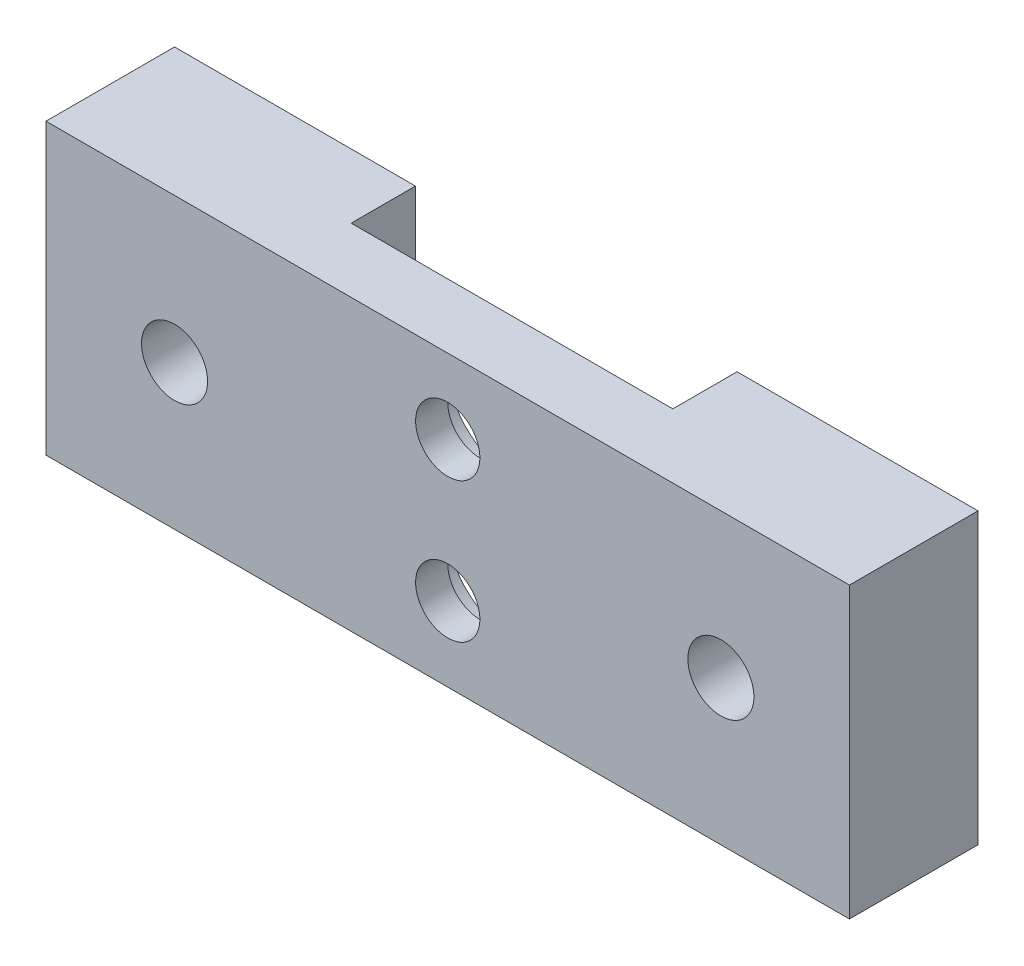
ISO-10303-21;
HEADER;
FILE_DESCRIPTION(('STEP AP214'),'2;1');
FILE_NAME('part.step','',(''),(''),'','','');
FILE_SCHEMA(('AUTOMOTIVE_DESIGN { 1 0 10303 214 1 1 1 1 }'));
ENDSEC;
DATA;
#1=APPLICATION_CONTEXT('core data for automotive mechanical design processes');
#2=APPLICATION_PROTOCOL_DEFINITION('international standard','automotive_design',2000,#1);
#3=PRODUCT_CONTEXT('',#1,'mechanical');
#4=PRODUCT('Part','Part','',(#3));
#5=PRODUCT_RELATED_PRODUCT_CATEGORY('part','',(#4));
#6=PRODUCT_DEFINITION_FORMATION('','',#4);
#7=PRODUCT_DEFINITION_CONTEXT('part definition',#1,'design');
#8=PRODUCT_DEFINITION('design','',#6,#7);
#9=PRODUCT_DEFINITION_SHAPE('','',#8);
#10=(LENGTH_UNIT() NAMED_UNIT(*) SI_UNIT(.MILLI.,.METRE.));
#11=(NAMED_UNIT(*) PLANE_ANGLE_UNIT() SI_UNIT($,.RADIAN.));
#12=(NAMED_UNIT(*) SI_UNIT($,.STERADIAN.) SOLID_ANGLE_UNIT());
#13=UNCERTAINTY_MEASURE_WITH_UNIT(LENGTH_MEASURE(1.E-05),#10,'distance_accuracy_value','');
#14=(GEOMETRIC_REPRESENTATION_CONTEXT(3) GLOBAL_UNCERTAINTY_ASSIGNED_CONTEXT((#13)) GLOBAL_UNIT_ASSIGNED_CONTEXT((#10,
#11,#12)) REPRESENTATION_CONTEXT('',''));
#15=CARTESIAN_POINT('',(0.,0.,0.));
#16=DIRECTION('',(0.,0.,1.));
#17=DIRECTION('',(1.,0.,0.));
#18=AXIS2_PLACEMENT_3D('',#15,#16,#17);
#19=CARTESIAN_POINT('',(-39.6875,28.575,-12.7));
#20=DIRECTION('',(1.,0.,0.));
#21=DIRECTION('',(0.,0.,-1.));
#22=AXIS2_PLACEMENT_3D('',#19,#20,#21);
#23=PLANE('',#22);
#24=DIRECTION('',(0.,0.,1.));
#25=VECTOR('',#24,1.);
#26=CARTESIAN_POINT('',(-39.6875,0.,-12.7));
#27=LINE('',#26,#25);
#28=CARTESIAN_POINT('',(-39.6875,0.,-12.7));
#29=VERTEX_POINT('',#28);
#30=CARTESIAN_POINT('',(-39.6875,0.,0.));
#31=VERTEX_POINT('',#30);
#32=EDGE_CURVE('E131',#29,#31,#27,.T.);
#33=ORIENTED_EDGE('',*,*,#32,.T.);
#34=DIRECTION('',(0.,-1.,0.));
#35=VECTOR('',#34,1.);
#36=CARTESIAN_POINT('',(-39.6875,28.575,0.));
#37=LINE('',#36,#35);
#38=CARTESIAN_POINT('',(-39.6875,28.575,0.));
#39=VERTEX_POINT('',#38);
#40=EDGE_CURVE('E11',#39,#31,#37,.T.);
#41=ORIENTED_EDGE('',*,*,#40,.F.);
#42=DIRECTION('',(0.,0.,1.));
#43=VECTOR('',#42,1.);
#44=CARTESIAN_POINT('',(-39.6875,28.575,-12.7));
#45=LINE('',#44,#43);
#46=CARTESIAN_POINT('',(-39.6875,28.575,-12.7));
#47=VERTEX_POINT('',#46);
#48=EDGE_CURVE('E146',#47,#39,#45,.T.);
#49=ORIENTED_EDGE('',*,*,#48,.F.);
#50=DIRECTION('',(0.,-1.,0.));
#51=VECTOR('',#50,1.);
#52=CARTESIAN_POINT('',(-39.6875,28.575,-12.7));
#53=LINE('',#52,#51);
#54=EDGE_CURVE('E127',#47,#29,#53,.T.);
#55=ORIENTED_EDGE('',*,*,#54,.T.);
#56=EDGE_LOOP('',(#33,#41,#49,#55));
#57=FACE_BOUND('',#56,.T.);
#58=ADVANCED_FACE('F35',(#57),#23,.F.);
#59=CARTESIAN_POINT('',(-39.6875,28.575,0.));
#60=DIRECTION('',(0.,0.,-1.));
#61=DIRECTION('',(-1.,0.,0.));
#62=AXIS2_PLACEMENT_3D('',#59,#60,#61);
#63=PLANE('',#62);
#64=CARTESIAN_POINT('',(0.,21.1963,0.));
#65=DIRECTION('',(0.,0.,-1.));
#66=DIRECTION('',(-1.,0.,0.));
#67=AXIS2_PLACEMENT_3D('',#64,#65,#66);
#68=CIRCLE('',#67,3.175);
#69=CARTESIAN_POINT('',(-3.175,21.1963,0.));
#70=VERTEX_POINT('',#69);
#71=EDGE_CURVE('E202',#70,#70,#68,.T.);
#72=ORIENTED_EDGE('',*,*,#71,.T.);
#73=EDGE_LOOP('',(#72));
#74=FACE_BOUND('',#73,.T.);
#75=CARTESIAN_POINT('',(0.,7.3787,0.));
#76=DIRECTION('',(0.,0.,-1.));
#77=DIRECTION('',(-1.,0.,0.));
#78=AXIS2_PLACEMENT_3D('',#75,#76,#77);
#79=CIRCLE('',#78,3.175);
#80=CARTESIAN_POINT('',(-3.175,7.3787,0.));
#81=VERTEX_POINT('',#80);
#82=EDGE_CURVE('E190',#81,#81,#79,.T.);
#83=ORIENTED_EDGE('',*,*,#82,.T.);
#84=EDGE_LOOP('',(#83));
#85=FACE_BOUND('',#84,.T.);
#86=CARTESIAN_POINT('',(-26.9875,14.2875,0.));
#87=DIRECTION('',(0.,0.,-1.));
#88=DIRECTION('',(-1.,0.,0.));
#89=AXIS2_PLACEMENT_3D('',#86,#87,#88);
#90=CIRCLE('',#89,3.2639);
#91=CARTESIAN_POINT('',(-30.2514,14.2875,0.));
#92=VERTEX_POINT('',#91);
#93=EDGE_CURVE('E184',#92,#92,#90,.T.);
#94=ORIENTED_EDGE('',*,*,#93,.T.);
#95=EDGE_LOOP('',(#94));
#96=FACE_BOUND('',#95,.T.);
#97=CARTESIAN_POINT('',(26.9875,14.2875,0.));
#98=DIRECTION('',(0.,0.,-1.));
#99=DIRECTION('',(-1.,0.,0.));
#100=AXIS2_PLACEMENT_3D('',#97,#98,#99);
#101=CIRCLE('',#100,3.2639);
#102=CARTESIAN_POINT('',(23.7236,14.2875,0.));
#103=VERTEX_POINT('',#102);
#104=EDGE_CURVE('E135',#103,#103,#101,.T.);
#105=ORIENTED_EDGE('',*,*,#104,.T.);
#106=EDGE_LOOP('',(#105));
#107=FACE_BOUND('',#106,.T.);
#108=DIRECTION('',(1.,0.,0.));
#109=VECTOR('',#108,1.);
#110=CARTESIAN_POINT('',(-39.6875,0.,0.));
#111=LINE('',#110,#109);
#112=CARTESIAN_POINT('',(39.6875,0.,0.));
#113=VERTEX_POINT('',#112);
#114=EDGE_CURVE('E134',#31,#113,#111,.T.);
#115=ORIENTED_EDGE('',*,*,#114,.T.);
#116=DIRECTION('',(0.,-1.,0.));
#117=VECTOR('',#116,1.);
#118=CARTESIAN_POINT('',(39.6875,28.575,0.));
#119=LINE('',#118,#117);
#120=CARTESIAN_POINT('',(39.6875,28.575,0.));
#121=VERTEX_POINT('',#120);
#122=EDGE_CURVE('E43',#121,#113,#119,.T.);
#123=ORIENTED_EDGE('',*,*,#122,.F.);
#124=DIRECTION('',(1.,0.,0.));
#125=VECTOR('',#124,1.);
#126=CARTESIAN_POINT('',(-39.6875,28.575,0.));
#127=LINE('',#126,#125);
#128=EDGE_CURVE('E94',#39,#121,#127,.T.);
#129=ORIENTED_EDGE('',*,*,#128,.F.);
#130=ORIENTED_EDGE('',*,*,#40,.T.);
#131=EDGE_LOOP('',(#115,#123,#129,#130));
#132=FACE_BOUND('',#131,.T.);
#133=ADVANCED_FACE('F240',(#74,#85,#96,#107,#132),#63,.F.);
#134=CARTESIAN_POINT('',(39.6875,28.575,0.));
#135=DIRECTION('',(-1.,0.,0.));
#136=DIRECTION('',(0.,0.,1.));
#137=AXIS2_PLACEMENT_3D('',#134,#135,#136);
#138=PLANE('',#137);
#139=DIRECTION('',(0.,0.,-1.));
#140=VECTOR('',#139,1.);
#141=CARTESIAN_POINT('',(39.6875,0.,0.));
#142=LINE('',#141,#140);
#143=CARTESIAN_POINT('',(39.6875,0.,-12.7));
#144=VERTEX_POINT('',#143);
#145=EDGE_CURVE('E137',#113,#144,#142,.T.);
#146=ORIENTED_EDGE('',*,*,#145,.T.);
#147=DIRECTION('',(0.,-1.,0.));
#148=VECTOR('',#147,1.);
#149=CARTESIAN_POINT('',(39.6875,28.575,-12.7));
#150=LINE('',#149,#148);
#151=CARTESIAN_POINT('',(39.6875,28.575,-12.7));
#152=VERTEX_POINT('',#151);
#153=EDGE_CURVE('E153',#152,#144,#150,.T.);
#154=ORIENTED_EDGE('',*,*,#153,.F.);
#155=DIRECTION('',(0.,0.,-1.));
#156=VECTOR('',#155,1.);
#157=CARTESIAN_POINT('',(39.6875,28.575,0.));
#158=LINE('',#157,#156);
#159=EDGE_CURVE('E161',#121,#152,#158,.T.);
#160=ORIENTED_EDGE('',*,*,#159,.F.);
#161=ORIENTED_EDGE('',*,*,#122,.T.);
#162=EDGE_LOOP('',(#146,#154,#160,#161));
#163=FACE_BOUND('',#162,.T.);
#164=ADVANCED_FACE('F159',(#163),#138,.F.);
#165=CARTESIAN_POINT('',(39.6875,28.575,-12.7));
#166=DIRECTION('',(0.,0.,1.));
#167=DIRECTION('',(1.,0.,0.));
#168=AXIS2_PLACEMENT_3D('',#165,#166,#167);
#169=PLANE('',#168);
#170=CARTESIAN_POINT('',(26.9875,14.2875,-12.7));
#171=DIRECTION('',(0.,0.,-1.));
#172=DIRECTION('',(-1.,0.,0.));
#173=AXIS2_PLACEMENT_3D('',#170,#171,#172);
#174=CIRCLE('',#173,3.2639);
#175=CARTESIAN_POINT('',(23.7236,14.2875,-12.7));
#176=VERTEX_POINT('',#175);
#177=EDGE_CURVE('E181',#176,#176,#174,.T.);
#178=ORIENTED_EDGE('',*,*,#177,.F.);
#179=EDGE_LOOP('',(#178));
#180=FACE_BOUND('',#179,.T.);
#181=DIRECTION('',(-1.,0.,0.));
#182=VECTOR('',#181,1.);
#183=CARTESIAN_POINT('',(39.6875,0.,-12.7));
#184=LINE('',#183,#182);
#185=CARTESIAN_POINT('',(15.8877,0.,-12.7));
#186=VERTEX_POINT('',#185);
#187=EDGE_CURVE('E139',#144,#186,#184,.T.);
#188=ORIENTED_EDGE('',*,*,#187,.T.);
#189=DIRECTION('',(0.,-1.,0.));
#190=VECTOR('',#189,1.);
#191=CARTESIAN_POINT('',(15.8877,28.575,-12.7));
#192=LINE('',#191,#190);
#193=CARTESIAN_POINT('',(15.8877,28.575,-12.7));
#194=VERTEX_POINT('',#193);
#195=EDGE_CURVE('E150',#194,#186,#192,.T.);
#196=ORIENTED_EDGE('',*,*,#195,.F.);
#197=DIRECTION('',(-1.,0.,0.));
#198=VECTOR('',#197,1.);
#199=CARTESIAN_POINT('',(39.6875,28.575,-12.7));
#200=LINE('',#199,#198);
#201=EDGE_CURVE('E173',#152,#194,#200,.T.);
#202=ORIENTED_EDGE('',*,*,#201,.F.);
#203=ORIENTED_EDGE('',*,*,#153,.T.);
#204=EDGE_LOOP('',(#188,#196,#202,#203));
#205=FACE_BOUND('',#204,.T.);
#206=ADVANCED_FACE('F169',(#180,#205),#169,.F.);
#207=CARTESIAN_POINT('',(15.8877,28.575,-12.7));
#208=DIRECTION('',(1.,0.,0.));
#209=DIRECTION('',(0.,0.,-1.));
#210=AXIS2_PLACEMENT_3D('',#207,#208,#209);
#211=PLANE('',#210);
#212=DIRECTION('',(0.,0.,1.));
#213=VECTOR('',#212,1.);
#214=CARTESIAN_POINT('',(15.8877,0.,-12.7));
#215=LINE('',#214,#213);
#216=CARTESIAN_POINT('',(15.8877,0.,-6.35));
#217=VERTEX_POINT('',#216);
#218=EDGE_CURVE('E141',#186,#217,#215,.T.);
#219=ORIENTED_EDGE('',*,*,#218,.T.);
#220=DIRECTION('',(0.,-1.,0.));
#221=VECTOR('',#220,1.);
#222=CARTESIAN_POINT('',(15.8877,28.575,-6.35));
#223=LINE('',#222,#221);
#224=CARTESIAN_POINT('',(15.8877,28.575,-6.35));
#225=VERTEX_POINT('',#224);
#226=EDGE_CURVE('E122',#225,#217,#223,.T.);
#227=ORIENTED_EDGE('',*,*,#226,.F.);
#228=DIRECTION('',(0.,0.,1.));
#229=VECTOR('',#228,1.);
#230=CARTESIAN_POINT('',(15.8877,28.575,-12.7));
#231=LINE('',#230,#229);
#232=EDGE_CURVE('E113',#194,#225,#231,.T.);
#233=ORIENTED_EDGE('',*,*,#232,.F.);
#234=ORIENTED_EDGE('',*,*,#195,.T.);
#235=EDGE_LOOP('',(#219,#227,#233,#234));
#236=FACE_BOUND('',#235,.T.);
#237=ADVANCED_FACE('F172',(#236),#211,.F.);
#238=CARTESIAN_POINT('',(15.8877,28.575,-6.35));
#239=DIRECTION('',(0.,0.,1.));
#240=DIRECTION('',(1.,0.,0.));
#241=AXIS2_PLACEMENT_3D('',#238,#239,#240);
#242=PLANE('',#241);
#243=CARTESIAN_POINT('',(0.,21.1963,-6.35));
#244=DIRECTION('',(0.,0.,-1.));
#245=DIRECTION('',(-1.,0.,0.));
#246=AXIS2_PLACEMENT_3D('',#243,#244,#245);
#247=CIRCLE('',#246,6.35);
#248=CARTESIAN_POINT('',(-6.35,21.1963,-6.35));
#249=VERTEX_POINT('',#248);
#250=EDGE_CURVE('E211',#249,#249,#247,.T.);
#251=ORIENTED_EDGE('',*,*,#250,.F.);
#252=EDGE_LOOP('',(#251));
#253=FACE_BOUND('',#252,.T.);
#254=CARTESIAN_POINT('',(0.,7.3787,-6.35));
#255=DIRECTION('',(0.,0.,-1.));
#256=DIRECTION('',(-1.,0.,0.));
#257=AXIS2_PLACEMENT_3D('',#254,#255,#256);
#258=CIRCLE('',#257,6.35);
#259=CARTESIAN_POINT('',(-6.35,7.3787,-6.35));
#260=VERTEX_POINT('',#259);
#261=EDGE_CURVE('E199',#260,#260,#258,.T.);
#262=ORIENTED_EDGE('',*,*,#261,.F.);
#263=EDGE_LOOP('',(#262));
#264=FACE_BOUND('',#263,.T.);
#265=DIRECTION('',(-1.,0.,0.));
#266=VECTOR('',#265,1.);
#267=CARTESIAN_POINT('',(15.8877,0.,-6.35));
#268=LINE('',#267,#266);
#269=CARTESIAN_POINT('',(-15.8877,0.,-6.35));
#270=VERTEX_POINT('',#269);
#271=EDGE_CURVE('E121',#217,#270,#268,.T.);
#272=ORIENTED_EDGE('',*,*,#271,.T.);
#273=DIRECTION('',(0.,-1.,0.));
#274=VECTOR('',#273,1.);
#275=CARTESIAN_POINT('',(-15.8877,28.575,-6.35));
#276=LINE('',#275,#274);
#277=CARTESIAN_POINT('',(-15.8877,28.575,-6.35));
#278=VERTEX_POINT('',#277);
#279=EDGE_CURVE('E118',#278,#270,#276,.T.);
#280=ORIENTED_EDGE('',*,*,#279,.F.);
#281=DIRECTION('',(-1.,0.,0.));
#282=VECTOR('',#281,1.);
#283=CARTESIAN_POINT('',(15.8877,28.575,-6.35));
#284=LINE('',#283,#282);
#285=EDGE_CURVE('E107',#225,#278,#284,.T.);
#286=ORIENTED_EDGE('',*,*,#285,.F.);
#287=ORIENTED_EDGE('',*,*,#226,.T.);
#288=EDGE_LOOP('',(#272,#280,#286,#287));
#289=FACE_BOUND('',#288,.T.);
#290=ADVANCED_FACE('F119',(#253,#264,#289),#242,.F.);
#291=CARTESIAN_POINT('',(-15.8877,28.575,-6.35));
#292=DIRECTION('',(-1.,0.,0.));
#293=DIRECTION('',(0.,0.,1.));
#294=AXIS2_PLACEMENT_3D('',#291,#292,#293);
#295=PLANE('',#294);
#296=DIRECTION('',(0.,0.,-1.));
#297=VECTOR('',#296,1.);
#298=CARTESIAN_POINT('',(-15.8877,0.,-6.35));
#299=LINE('',#298,#297);
#300=CARTESIAN_POINT('',(-15.8877,0.,-12.7));
#301=VERTEX_POINT('',#300);
#302=EDGE_CURVE('E80',#270,#301,#299,.T.);
#303=ORIENTED_EDGE('',*,*,#302,.T.);
#304=DIRECTION('',(0.,-1.,0.));
#305=VECTOR('',#304,1.);
#306=CARTESIAN_POINT('',(-15.8877,28.575,-12.7));
#307=LINE('',#306,#305);
#308=CARTESIAN_POINT('',(-15.8877,28.575,-12.7));
#309=VERTEX_POINT('',#308);
#310=EDGE_CURVE('E123',#309,#301,#307,.T.);
#311=ORIENTED_EDGE('',*,*,#310,.F.);
#312=DIRECTION('',(0.,0.,-1.));
#313=VECTOR('',#312,1.);
#314=CARTESIAN_POINT('',(-15.8877,28.575,-6.35));
#315=LINE('',#314,#313);
#316=EDGE_CURVE('E111',#278,#309,#315,.T.);
#317=ORIENTED_EDGE('',*,*,#316,.F.);
#318=ORIENTED_EDGE('',*,*,#279,.T.);
#319=EDGE_LOOP('',(#303,#311,#317,#318));
#320=FACE_BOUND('',#319,.T.);
#321=ADVANCED_FACE('F125',(#320),#295,.F.);
#322=CARTESIAN_POINT('',(-15.8877,28.575,-12.7));
#323=DIRECTION('',(0.,0.,1.));
#324=DIRECTION('',(1.,0.,0.));
#325=AXIS2_PLACEMENT_3D('',#322,#323,#324);
#326=PLANE('',#325);
#327=CARTESIAN_POINT('',(-26.9875,14.2875,-12.7));
#328=DIRECTION('',(0.,0.,-1.));
#329=DIRECTION('',(-1.,0.,0.));
#330=AXIS2_PLACEMENT_3D('',#327,#328,#329);
#331=CIRCLE('',#330,3.2639);
#332=CARTESIAN_POINT('',(-30.2514,14.2875,-12.7));
#333=VERTEX_POINT('',#332);
#334=EDGE_CURVE('E187',#333,#333,#331,.T.);
#335=ORIENTED_EDGE('',*,*,#334,.F.);
#336=EDGE_LOOP('',(#335));
#337=FACE_BOUND('',#336,.T.);
#338=DIRECTION('',(-1.,0.,0.));
#339=VECTOR('',#338,1.);
#340=CARTESIAN_POINT('',(-15.8877,0.,-12.7));
#341=LINE('',#340,#339);
#342=EDGE_CURVE('E86',#301,#29,#341,.T.);
#343=ORIENTED_EDGE('',*,*,#342,.T.);
#344=ORIENTED_EDGE('',*,*,#54,.F.);
#345=DIRECTION('',(-1.,0.,0.));
#346=VECTOR('',#345,1.);
#347=CARTESIAN_POINT('',(-15.8877,28.575,-12.7));
#348=LINE('',#347,#346);
#349=EDGE_CURVE('E51',#309,#47,#348,.T.);
#350=ORIENTED_EDGE('',*,*,#349,.F.);
#351=ORIENTED_EDGE('',*,*,#310,.T.);
#352=EDGE_LOOP('',(#343,#344,#350,#351));
#353=FACE_BOUND('',#352,.T.);
#354=ADVANCED_FACE('F248',(#337,#353),#326,.F.);
#355=CARTESIAN_POINT('',(0.,28.575,0.));
#356=DIRECTION('',(0.,1.,0.));
#357=DIRECTION('',(0.,0.,1.));
#358=AXIS2_PLACEMENT_3D('',#355,#356,#357);
#359=PLANE('',#358);
#360=ORIENTED_EDGE('',*,*,#48,.T.);
#361=ORIENTED_EDGE('',*,*,#128,.T.);
#362=ORIENTED_EDGE('',*,*,#159,.T.);
#363=ORIENTED_EDGE('',*,*,#201,.T.);
#364=ORIENTED_EDGE('',*,*,#232,.T.);
#365=ORIENTED_EDGE('',*,*,#285,.T.);
#366=ORIENTED_EDGE('',*,*,#316,.T.);
#367=ORIENTED_EDGE('',*,*,#349,.T.);
#368=EDGE_LOOP('',(#360,#361,#362,#363,#364,#365,#366,#367));
#369=FACE_BOUND('',#368,.T.);
#370=ADVANCED_FACE('F109',(#369),#359,.T.);
#371=CARTESIAN_POINT('',(0.,0.,0.));
#372=DIRECTION('',(0.,1.,0.));
#373=DIRECTION('',(0.,0.,1.));
#374=AXIS2_PLACEMENT_3D('',#371,#372,#373);
#375=PLANE('',#374);
#376=ORIENTED_EDGE('',*,*,#32,.F.);
#377=ORIENTED_EDGE('',*,*,#342,.F.);
#378=ORIENTED_EDGE('',*,*,#302,.F.);
#379=ORIENTED_EDGE('',*,*,#271,.F.);
#380=ORIENTED_EDGE('',*,*,#218,.F.);
#381=ORIENTED_EDGE('',*,*,#187,.F.);
#382=ORIENTED_EDGE('',*,*,#145,.F.);
#383=ORIENTED_EDGE('',*,*,#114,.F.);
#384=EDGE_LOOP('',(#376,#377,#378,#379,#380,#381,#382,#383));
#385=FACE_BOUND('',#384,.T.);
#386=ADVANCED_FACE('F165',(#385),#375,.F.);
#387=CARTESIAN_POINT('',(26.9875,14.2875,-12.7));
#388=DIRECTION('',(0.,0.,-1.));
#389=DIRECTION('',(-1.,0.,0.));
#390=AXIS2_PLACEMENT_3D('',#387,#388,#389);
#391=CYLINDRICAL_SURFACE('',#390,3.2639);
#392=ORIENTED_EDGE('',*,*,#104,.F.);
#393=EDGE_LOOP('',(#392));
#394=FACE_BOUND('',#393,.T.);
#395=ORIENTED_EDGE('',*,*,#177,.T.);
#396=EDGE_LOOP('',(#395));
#397=FACE_BOUND('',#396,.T.);
#398=ADVANCED_FACE('F303',(#394,#397),#391,.F.);
#399=CARTESIAN_POINT('',(-26.9875,14.2875,-12.7));
#400=DIRECTION('',(0.,0.,-1.));
#401=DIRECTION('',(-1.,0.,0.));
#402=AXIS2_PLACEMENT_3D('',#399,#400,#401);
#403=CYLINDRICAL_SURFACE('',#402,3.2639);
#404=ORIENTED_EDGE('',*,*,#93,.F.);
#405=EDGE_LOOP('',(#404));
#406=FACE_BOUND('',#405,.T.);
#407=ORIENTED_EDGE('',*,*,#334,.T.);
#408=EDGE_LOOP('',(#407));
#409=FACE_BOUND('',#408,.T.);
#410=ADVANCED_FACE('F312',(#406,#409),#403,.F.);
#411=CARTESIAN_POINT('',(0.,7.3787,-6.35));
#412=DIRECTION('',(0.,0.,-1.));
#413=DIRECTION('',(-1.,0.,0.));
#414=AXIS2_PLACEMENT_3D('',#411,#412,#413);
#415=CYLINDRICAL_SURFACE('',#414,3.175);
#416=ORIENTED_EDGE('',*,*,#82,.F.);
#417=EDGE_LOOP('',(#416));
#418=FACE_BOUND('',#417,.T.);
#419=CARTESIAN_POINT('',(0.,7.3787,-3.175));
#420=DIRECTION('',(0.,0.,-1.));
#421=DIRECTION('',(-1.,0.,0.));
#422=AXIS2_PLACEMENT_3D('',#419,#420,#421);
#423=CIRCLE('',#422,3.175);
#424=CARTESIAN_POINT('',(-3.175,7.3787,-3.175));
#425=VERTEX_POINT('',#424);
#426=EDGE_CURVE('E193',#425,#425,#423,.T.);
#427=ORIENTED_EDGE('',*,*,#426,.T.);
#428=EDGE_LOOP('',(#427));
#429=FACE_BOUND('',#428,.T.);
#430=ADVANCED_FACE('F235',(#418,#429),#415,.F.);
#431=CARTESIAN_POINT('',(3.175,7.3787,-3.175));
#432=DIRECTION('',(0.,0.,1.));
#433=DIRECTION('',(1.,0.,0.));
#434=AXIS2_PLACEMENT_3D('',#431,#432,#433);
#435=PLANE('',#434);
#436=ORIENTED_EDGE('',*,*,#426,.F.);
#437=EDGE_LOOP('',(#436));
#438=FACE_BOUND('',#437,.T.);
#439=CARTESIAN_POINT('',(0.,7.3787,-3.175));
#440=DIRECTION('',(0.,0.,-1.));
#441=DIRECTION('',(-1.,0.,0.));
#442=AXIS2_PLACEMENT_3D('',#439,#440,#441);
#443=CIRCLE('',#442,6.35);
#444=CARTESIAN_POINT('',(-6.35,7.3787,-3.175));
#445=VERTEX_POINT('',#444);
#446=EDGE_CURVE('E196',#445,#445,#443,.T.);
#447=ORIENTED_EDGE('',*,*,#446,.T.);
#448=EDGE_LOOP('',(#447));
#449=FACE_BOUND('',#448,.T.);
#450=ADVANCED_FACE('F225',(#438,#449),#435,.F.);
#451=CARTESIAN_POINT('',(0.,7.3787,-6.35));
#452=DIRECTION('',(0.,0.,-1.));
#453=DIRECTION('',(-1.,0.,0.));
#454=AXIS2_PLACEMENT_3D('',#451,#452,#453);
#455=CYLINDRICAL_SURFACE('',#454,6.35);
#456=ORIENTED_EDGE('',*,*,#446,.F.);
#457=EDGE_LOOP('',(#456));
#458=FACE_BOUND('',#457,.T.);
#459=ORIENTED_EDGE('',*,*,#261,.T.);
#460=EDGE_LOOP('',(#459));
#461=FACE_BOUND('',#460,.T.);
#462=ADVANCED_FACE('F222',(#458,#461),#455,.F.);
#463=CARTESIAN_POINT('',(0.,21.1963,-6.35));
#464=DIRECTION('',(0.,0.,-1.));
#465=DIRECTION('',(-1.,0.,0.));
#466=AXIS2_PLACEMENT_3D('',#463,#464,#465);
#467=CYLINDRICAL_SURFACE('',#466,3.175);
#468=ORIENTED_EDGE('',*,*,#71,.F.);
#469=EDGE_LOOP('',(#468));
#470=FACE_BOUND('',#469,.T.);
#471=CARTESIAN_POINT('',(0.,21.1963,-3.175));
#472=DIRECTION('',(0.,0.,-1.));
#473=DIRECTION('',(-1.,0.,0.));
#474=AXIS2_PLACEMENT_3D('',#471,#472,#473);
#475=CIRCLE('',#474,3.175);
#476=CARTESIAN_POINT('',(-3.175,21.1963,-3.175));
#477=VERTEX_POINT('',#476);
#478=EDGE_CURVE('E205',#477,#477,#475,.T.);
#479=ORIENTED_EDGE('',*,*,#478,.T.);
#480=EDGE_LOOP('',(#479));
#481=FACE_BOUND('',#480,.T.);
#482=ADVANCED_FACE('F224',(#470,#481),#467,.F.);
#483=CARTESIAN_POINT('',(3.175,21.1963,-3.175));
#484=DIRECTION('',(0.,0.,1.));
#485=DIRECTION('',(1.,0.,0.));
#486=AXIS2_PLACEMENT_3D('',#483,#484,#485);
#487=PLANE('',#486);
#488=ORIENTED_EDGE('',*,*,#478,.F.);
#489=EDGE_LOOP('',(#488));
#490=FACE_BOUND('',#489,.T.);
#491=CARTESIAN_POINT('',(0.,21.1963,-3.175));
#492=DIRECTION('',(0.,0.,-1.));
#493=DIRECTION('',(-1.,0.,0.));
#494=AXIS2_PLACEMENT_3D('',#491,#492,#493);
#495=CIRCLE('',#494,6.35);
#496=CARTESIAN_POINT('',(-6.35,21.1963,-3.175));
#497=VERTEX_POINT('',#496);
#498=EDGE_CURVE('E208',#497,#497,#495,.T.);
#499=ORIENTED_EDGE('',*,*,#498,.T.);
#500=EDGE_LOOP('',(#499));
#501=FACE_BOUND('',#500,.T.);
#502=ADVANCED_FACE('F232',(#490,#501),#487,.F.);
#503=CARTESIAN_POINT('',(0.,21.1963,-6.35));
#504=DIRECTION('',(0.,0.,-1.));
#505=DIRECTION('',(-1.,0.,0.));
#506=AXIS2_PLACEMENT_3D('',#503,#504,#505);
#507=CYLINDRICAL_SURFACE('',#506,6.35);
#508=ORIENTED_EDGE('',*,*,#498,.F.);
#509=EDGE_LOOP('',(#508));
#510=FACE_BOUND('',#509,.T.);
#511=ORIENTED_EDGE('',*,*,#250,.T.);
#512=EDGE_LOOP('',(#511));
#513=FACE_BOUND('',#512,.T.);
#514=ADVANCED_FACE('F215',(#510,#513),#507,.F.);
#515=CLOSED_SHELL('',(#58,#133,#164,#206,#237,#290,#321,#354,#370,#386,#398,#410,#430,#450,#462,
#482,#502,#514));
#516=MANIFOLD_SOLID_BREP('B2',#515);
#517=ADVANCED_BREP_SHAPE_REPRESENTATION('',(#18,#516),#14);
#518=SHAPE_DEFINITION_REPRESENTATION(#9,#517);
ENDSEC;
END-ISO-10303-21;
